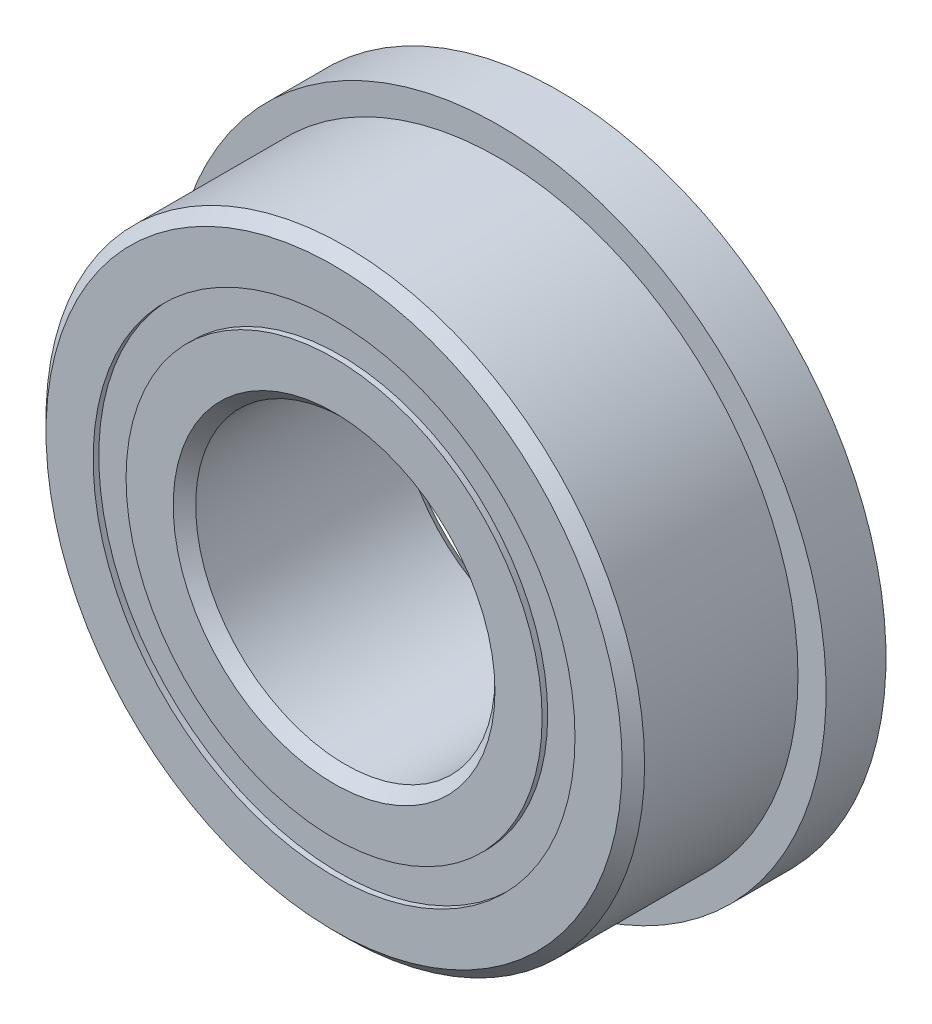
ISO-10303-21;
HEADER;
FILE_DESCRIPTION(('STEP AP214'),'2;1');
FILE_NAME('part.step','',(''),(''),'','','');
FILE_SCHEMA(('AUTOMOTIVE_DESIGN { 1 0 10303 214 1 1 1 1 }'));
ENDSEC;
DATA;
#1=APPLICATION_CONTEXT('core data for automotive mechanical design processes');
#2=APPLICATION_PROTOCOL_DEFINITION('international standard','automotive_design',2000,#1);
#3=PRODUCT_CONTEXT('',#1,'mechanical');
#4=PRODUCT('Part','Part','',(#3));
#5=PRODUCT_RELATED_PRODUCT_CATEGORY('part','',(#4));
#6=PRODUCT_DEFINITION_FORMATION('','',#4);
#7=PRODUCT_DEFINITION_CONTEXT('part definition',#1,'design');
#8=PRODUCT_DEFINITION('design','',#6,#7);
#9=PRODUCT_DEFINITION_SHAPE('','',#8);
#10=(LENGTH_UNIT() NAMED_UNIT(*) SI_UNIT(.MILLI.,.METRE.));
#11=(NAMED_UNIT(*) PLANE_ANGLE_UNIT() SI_UNIT($,.RADIAN.));
#12=(NAMED_UNIT(*) SI_UNIT($,.STERADIAN.) SOLID_ANGLE_UNIT());
#13=UNCERTAINTY_MEASURE_WITH_UNIT(LENGTH_MEASURE(1.E-05),#10,'distance_accuracy_value','');
#14=(GEOMETRIC_REPRESENTATION_CONTEXT(3) GLOBAL_UNCERTAINTY_ASSIGNED_CONTEXT((#13)) GLOBAL_UNIT_ASSIGNED_CONTEXT((#10,
#11,#12)) REPRESENTATION_CONTEXT('',''));
#15=CARTESIAN_POINT('',(0.,0.,0.));
#16=DIRECTION('',(0.,0.,1.));
#17=DIRECTION('',(1.,0.,0.));
#18=AXIS2_PLACEMENT_3D('',#15,#16,#17);
#19=CARTESIAN_POINT('',(0.,5.1114010989011,-2.2621875));
#20=DIRECTION('',(0.,0.,1.));
#21=DIRECTION('',(1.,0.,0.));
#22=AXIS2_PLACEMENT_3D('',#19,#20,#21);
#23=PLANE('',#22);
#24=CARTESIAN_POINT('',(0.,0.,-2.2621875));
#25=DIRECTION('',(0.,0.,1.));
#26=DIRECTION('',(1.,0.,0.));
#27=AXIS2_PLACEMENT_3D('',#24,#25,#26);
#28=CIRCLE('',#27,5.1114010989011);
#29=CARTESIAN_POINT('',(5.1114010989011,0.,-2.2621875));
#30=VERTEX_POINT('',#29);
#31=EDGE_CURVE('E55',#30,#30,#28,.T.);
#32=ORIENTED_EDGE('',*,*,#31,.F.);
#33=EDGE_LOOP('',(#32));
#34=FACE_BOUND('',#33,.T.);
#35=CARTESIAN_POINT('',(0.,0.,-2.2621875));
#36=DIRECTION('',(0.,0.,1.));
#37=DIRECTION('',(1.,0.,0.));
#38=AXIS2_PLACEMENT_3D('',#35,#36,#37);
#39=CIRCLE('',#38,4.4135989010989);
#40=CARTESIAN_POINT('',(4.4135989010989,0.,-2.2621875));
#41=VERTEX_POINT('',#40);
#42=EDGE_CURVE('E11',#41,#41,#39,.T.);
#43=ORIENTED_EDGE('',*,*,#42,.T.);
#44=EDGE_LOOP('',(#43));
#45=FACE_BOUND('',#44,.T.);
#46=ADVANCED_FACE('F41',(#34,#45),#23,.F.);
#47=CARTESIAN_POINT('',(0.,0.,2.38125));
#48=DIRECTION('',(0.,0.,1.));
#49=DIRECTION('',(1.,0.,0.));
#50=AXIS2_PLACEMENT_3D('',#47,#48,#49);
#51=CYLINDRICAL_SURFACE('',#50,4.4135989010989);
#52=ORIENTED_EDGE('',*,*,#42,.F.);
#53=EDGE_LOOP('',(#52));
#54=FACE_BOUND('',#53,.T.);
#55=CARTESIAN_POINT('',(0.,0.,-1.11436144103197));
#56=DIRECTION('',(0.,0.,1.));
#57=DIRECTION('',(1.,0.,0.));
#58=AXIS2_PLACEMENT_3D('',#55,#56,#57);
#59=CIRCLE('',#58,4.4135989010989);
#60=CARTESIAN_POINT('',(4.4135989010989,0.,-1.11436144103197));
#61=VERTEX_POINT('',#60);
#62=EDGE_CURVE('E47',#61,#61,#59,.T.);
#63=ORIENTED_EDGE('',*,*,#62,.T.);
#64=EDGE_LOOP('',(#63));
#65=FACE_BOUND('',#64,.T.);
#66=ADVANCED_FACE('F64',(#54,#65),#51,.F.);
#67=CARTESIAN_POINT('',(0.,5.1114010989011,-1.11436144103197));
#68=DIRECTION('',(0.,0.,-1.));
#69=DIRECTION('',(-1.,0.,0.));
#70=AXIS2_PLACEMENT_3D('',#67,#68,#69);
#71=PLANE('',#70);
#72=ORIENTED_EDGE('',*,*,#62,.F.);
#73=EDGE_LOOP('',(#72));
#74=FACE_BOUND('',#73,.T.);
#75=CARTESIAN_POINT('',(0.,0.,-1.11436144103197));
#76=DIRECTION('',(0.,0.,1.));
#77=DIRECTION('',(1.,0.,0.));
#78=AXIS2_PLACEMENT_3D('',#75,#76,#77);
#79=CIRCLE('',#78,5.1114010989011);
#80=CARTESIAN_POINT('',(5.1114010989011,0.,-1.11436144103197));
#81=VERTEX_POINT('',#80);
#82=EDGE_CURVE('E51',#81,#81,#79,.T.);
#83=ORIENTED_EDGE('',*,*,#82,.T.);
#84=EDGE_LOOP('',(#83));
#85=FACE_BOUND('',#84,.T.);
#86=ADVANCED_FACE('F68',(#74,#85),#71,.F.);
#87=CARTESIAN_POINT('',(0.,0.,2.38125));
#88=DIRECTION('',(0.,0.,1.));
#89=DIRECTION('',(1.,0.,0.));
#90=AXIS2_PLACEMENT_3D('',#87,#88,#89);
#91=CYLINDRICAL_SURFACE('',#90,5.1114010989011);
#92=ORIENTED_EDGE('',*,*,#82,.F.);
#93=EDGE_LOOP('',(#92));
#94=FACE_BOUND('',#93,.T.);
#95=ORIENTED_EDGE('',*,*,#31,.T.);
#96=EDGE_LOOP('',(#95));
#97=FACE_BOUND('',#96,.T.);
#98=ADVANCED_FACE('F61',(#94,#97),#91,.T.);
#99=CLOSED_SHELL('',(#46,#66,#86,#98));
#100=MANIFOLD_SOLID_BREP('B2',#99);
#101=CARTESIAN_POINT('',(0.,5.1114010989011,2.2621875));
#102=DIRECTION('',(0.,0.,-1.));
#103=DIRECTION('',(-1.,0.,0.));
#104=AXIS2_PLACEMENT_3D('',#101,#102,#103);
#105=PLANE('',#104);
#106=CARTESIAN_POINT('',(0.,0.,2.2621875));
#107=DIRECTION('',(0.,0.,1.));
#108=DIRECTION('',(1.,0.,0.));
#109=AXIS2_PLACEMENT_3D('',#106,#107,#108);
#110=CIRCLE('',#109,4.4135989010989);
#111=CARTESIAN_POINT('',(4.4135989010989,0.,2.2621875));
#112=VERTEX_POINT('',#111);
#113=EDGE_CURVE('E40',#112,#112,#110,.T.);
#114=ORIENTED_EDGE('',*,*,#113,.F.);
#115=EDGE_LOOP('',(#114));
#116=FACE_BOUND('',#115,.T.);
#117=CARTESIAN_POINT('',(0.,0.,2.2621875));
#118=DIRECTION('',(0.,0.,1.));
#119=DIRECTION('',(1.,0.,0.));
#120=AXIS2_PLACEMENT_3D('',#117,#118,#119);
#121=CIRCLE('',#120,5.1114010989011);
#122=CARTESIAN_POINT('',(5.1114010989011,0.,2.2621875));
#123=VERTEX_POINT('',#122);
#124=EDGE_CURVE('E122',#123,#123,#121,.T.);
#125=ORIENTED_EDGE('',*,*,#124,.T.);
#126=EDGE_LOOP('',(#125));
#127=FACE_BOUND('',#126,.T.);
#128=ADVANCED_FACE('F108',(#116,#127),#105,.F.);
#129=CARTESIAN_POINT('',(0.,0.,2.38125));
#130=DIRECTION('',(0.,0.,1.));
#131=DIRECTION('',(1.,0.,0.));
#132=AXIS2_PLACEMENT_3D('',#129,#130,#131);
#133=CYLINDRICAL_SURFACE('',#132,4.4135989010989);
#134=CARTESIAN_POINT('',(0.,0.,1.11436144103197));
#135=DIRECTION('',(0.,0.,1.));
#136=DIRECTION('',(1.,0.,0.));
#137=AXIS2_PLACEMENT_3D('',#134,#135,#136);
#138=CIRCLE('',#137,4.4135989010989);
#139=CARTESIAN_POINT('',(4.4135989010989,0.,1.11436144103197));
#140=VERTEX_POINT('',#139);
#141=EDGE_CURVE('E114',#140,#140,#138,.T.);
#142=ORIENTED_EDGE('',*,*,#141,.F.);
#143=EDGE_LOOP('',(#142));
#144=FACE_BOUND('',#143,.T.);
#145=ORIENTED_EDGE('',*,*,#113,.T.);
#146=EDGE_LOOP('',(#145));
#147=FACE_BOUND('',#146,.T.);
#148=ADVANCED_FACE('F137',(#144,#147),#133,.F.);
#149=CARTESIAN_POINT('',(0.,5.1114010989011,1.11436144103197));
#150=DIRECTION('',(0.,0.,1.));
#151=DIRECTION('',(1.,0.,0.));
#152=AXIS2_PLACEMENT_3D('',#149,#150,#151);
#153=PLANE('',#152);
#154=CARTESIAN_POINT('',(0.,0.,1.11436144103197));
#155=DIRECTION('',(0.,0.,1.));
#156=DIRECTION('',(1.,0.,0.));
#157=AXIS2_PLACEMENT_3D('',#154,#155,#156);
#158=CIRCLE('',#157,5.1114010989011);
#159=CARTESIAN_POINT('',(5.1114010989011,0.,1.11436144103197));
#160=VERTEX_POINT('',#159);
#161=EDGE_CURVE('E118',#160,#160,#158,.T.);
#162=ORIENTED_EDGE('',*,*,#161,.F.);
#163=EDGE_LOOP('',(#162));
#164=FACE_BOUND('',#163,.T.);
#165=ORIENTED_EDGE('',*,*,#141,.T.);
#166=EDGE_LOOP('',(#165));
#167=FACE_BOUND('',#166,.T.);
#168=ADVANCED_FACE('F132',(#164,#167),#153,.F.);
#169=CARTESIAN_POINT('',(0.,0.,2.38125));
#170=DIRECTION('',(0.,0.,1.));
#171=DIRECTION('',(1.,0.,0.));
#172=AXIS2_PLACEMENT_3D('',#169,#170,#171);
#173=CYLINDRICAL_SURFACE('',#172,5.1114010989011);
#174=ORIENTED_EDGE('',*,*,#124,.F.);
#175=EDGE_LOOP('',(#174));
#176=FACE_BOUND('',#175,.T.);
#177=ORIENTED_EDGE('',*,*,#161,.T.);
#178=EDGE_LOOP('',(#177));
#179=FACE_BOUND('',#178,.T.);
#180=ADVANCED_FACE('F129',(#176,#179),#173,.T.);
#181=CLOSED_SHELL('',(#128,#148,#168,#180));
#182=MANIFOLD_SOLID_BREP('B6',#181);
#183=CARTESIAN_POINT('',(-2.38124999999995,4.12444598552342,0.));
#184=DIRECTION('',(0.,0.,1.));
#185=DIRECTION('',(-0.499999999999989,0.866025403784445,0.));
#186=AXIS2_PLACEMENT_3D('',#183,#184,#185);
#187=SPHERICAL_SURFACE('',#186,1.11436144103197);
#188=CARTESIAN_POINT('',(-2.38124999999995,4.12444598552342,1.11436144103197));
#189=VERTEX_POINT('',#188);
#190=VERTEX_LOOP('',#189);
#191=FACE_BOUND('',#190,.T.);
#192=ADVANCED_FACE('F175',(#191),#187,.T.);
#193=CLOSED_SHELL('',(#192));
#194=MANIFOLD_SOLID_BREP('B35',#193);
#195=CARTESIAN_POINT('',(-4.12444598552336,2.38125000000005,0.));
#196=DIRECTION('',(0.,0.,1.));
#197=DIRECTION('',(-0.866025403784433,0.50000000000001,0.));
#198=AXIS2_PLACEMENT_3D('',#195,#196,#197);
#199=SPHERICAL_SURFACE('',#198,1.11436144103197);
#200=CARTESIAN_POINT('',(-4.12444598552336,2.38125000000005,1.11436144103197));
#201=VERTEX_POINT('',#200);
#202=VERTEX_LOOP('',#201);
#203=FACE_BOUND('',#202,.T.);
#204=ADVANCED_FACE('F195',(#203),#199,.T.);
#205=CLOSED_SHELL('',(#204));
#206=MANIFOLD_SOLID_BREP('B104',#205);
#207=CARTESIAN_POINT('',(-4.7625,0.,0.));
#208=DIRECTION('',(0.,0.,1.));
#209=DIRECTION('',(-1.,0.,0.));
#210=AXIS2_PLACEMENT_3D('',#207,#208,#209);
#211=SPHERICAL_SURFACE('',#210,1.11436144103197);
#212=CARTESIAN_POINT('',(-4.7625,0.,1.11436144103197));
#213=VERTEX_POINT('',#212);
#214=VERTEX_LOOP('',#213);
#215=FACE_BOUND('',#214,.T.);
#216=ADVANCED_FACE('F215',(#215),#211,.T.);
#217=CLOSED_SHELL('',(#216));
#218=MANIFOLD_SOLID_BREP('B171',#217);
#219=CARTESIAN_POINT('',(-4.12444598552341,-2.38124999999996,0.));
#220=DIRECTION('',(0.,0.,1.));
#221=DIRECTION('',(-0.866025403784443,-0.499999999999992,0.));
#222=AXIS2_PLACEMENT_3D('',#219,#220,#221);
#223=SPHERICAL_SURFACE('',#222,1.11436144103197);
#224=CARTESIAN_POINT('',(-4.12444598552341,-2.38124999999996,1.11436144103197));
#225=VERTEX_POINT('',#224);
#226=VERTEX_LOOP('',#225);
#227=FACE_BOUND('',#226,.T.);
#228=ADVANCED_FACE('F235',(#227),#223,.T.);
#229=CLOSED_SHELL('',(#228));
#230=MANIFOLD_SOLID_BREP('B191',#229);
#231=CARTESIAN_POINT('',(-2.38125000000003,-4.12444598552337,0.));
#232=DIRECTION('',(0.,0.,1.));
#233=DIRECTION('',(-0.500000000000007,-0.866025403784435,0.));
#234=AXIS2_PLACEMENT_3D('',#231,#232,#233);
#235=SPHERICAL_SURFACE('',#234,1.11436144103197);
#236=CARTESIAN_POINT('',(-2.38125000000003,-4.12444598552337,1.11436144103197));
#237=VERTEX_POINT('',#236);
#238=VERTEX_LOOP('',#237);
#239=FACE_BOUND('',#238,.T.);
#240=ADVANCED_FACE('F255',(#239),#235,.T.);
#241=CLOSED_SHELL('',(#240));
#242=MANIFOLD_SOLID_BREP('B211',#241);
#243=CARTESIAN_POINT('',(0.,-4.7625,0.));
#244=DIRECTION('',(0.,0.,1.));
#245=DIRECTION('',(0.,-1.,0.));
#246=AXIS2_PLACEMENT_3D('',#243,#244,#245);
#247=SPHERICAL_SURFACE('',#246,1.11436144103197);
#248=CARTESIAN_POINT('',(0.,-4.7625,1.11436144103197));
#249=VERTEX_POINT('',#248);
#250=VERTEX_LOOP('',#249);
#251=FACE_BOUND('',#250,.T.);
#252=ADVANCED_FACE('F275',(#251),#247,.T.);
#253=CLOSED_SHELL('',(#252));
#254=MANIFOLD_SOLID_BREP('B231',#253);
#255=CARTESIAN_POINT('',(2.38124999999998,-4.1244459855234,0.));
#256=DIRECTION('',(0.,0.,1.));
#257=DIRECTION('',(0.499999999999995,-0.866025403784442,0.));
#258=AXIS2_PLACEMENT_3D('',#255,#256,#257);
#259=SPHERICAL_SURFACE('',#258,1.11436144103197);
#260=CARTESIAN_POINT('',(2.38124999999998,-4.1244459855234,1.11436144103197));
#261=VERTEX_POINT('',#260);
#262=VERTEX_LOOP('',#261);
#263=FACE_BOUND('',#262,.T.);
#264=ADVANCED_FACE('F295',(#263),#259,.T.);
#265=CLOSED_SHELL('',(#264));
#266=MANIFOLD_SOLID_BREP('B251',#265);
#267=CARTESIAN_POINT('',(4.12444598552338,-2.38125000000002,0.));
#268=DIRECTION('',(0.,0.,1.));
#269=DIRECTION('',(0.866025403784436,-0.500000000000004,0.));
#270=AXIS2_PLACEMENT_3D('',#267,#268,#269);
#271=SPHERICAL_SURFACE('',#270,1.11436144103197);
#272=CARTESIAN_POINT('',(4.12444598552338,-2.38125000000002,1.11436144103197));
#273=VERTEX_POINT('',#272);
#274=VERTEX_LOOP('',#273);
#275=FACE_BOUND('',#274,.T.);
#276=ADVANCED_FACE('F315',(#275),#271,.T.);
#277=CLOSED_SHELL('',(#276));
#278=MANIFOLD_SOLID_BREP('B271',#277);
#279=CARTESIAN_POINT('',(4.7625,0.,0.));
#280=DIRECTION('',(0.,0.,1.));
#281=DIRECTION('',(1.,0.,0.));
#282=AXIS2_PLACEMENT_3D('',#279,#280,#281);
#283=SPHERICAL_SURFACE('',#282,1.11436144103197);
#284=CARTESIAN_POINT('',(4.7625,0.,1.11436144103197));
#285=VERTEX_POINT('',#284);
#286=VERTEX_LOOP('',#285);
#287=FACE_BOUND('',#286,.T.);
#288=ADVANCED_FACE('F335',(#287),#283,.T.);
#289=CLOSED_SHELL('',(#288));
#290=MANIFOLD_SOLID_BREP('B291',#289);
#291=CARTESIAN_POINT('',(4.12444598552339,2.38124999999999,0.));
#292=DIRECTION('',(0.,0.,1.));
#293=DIRECTION('',(0.86602540378444,0.499999999999998,0.));
#294=AXIS2_PLACEMENT_3D('',#291,#292,#293);
#295=SPHERICAL_SURFACE('',#294,1.11436144103197);
#296=CARTESIAN_POINT('',(4.12444598552339,2.38124999999999,1.11436144103197));
#297=VERTEX_POINT('',#296);
#298=VERTEX_LOOP('',#297);
#299=FACE_BOUND('',#298,.T.);
#300=ADVANCED_FACE('F355',(#299),#295,.T.);
#301=CLOSED_SHELL('',(#300));
#302=MANIFOLD_SOLID_BREP('B311',#301);
#303=CARTESIAN_POINT('',(2.38125,4.12444598552339,0.));
#304=DIRECTION('',(0.,0.,1.));
#305=DIRECTION('',(0.500000000000001,0.866025403784438,0.));
#306=AXIS2_PLACEMENT_3D('',#303,#304,#305);
#307=SPHERICAL_SURFACE('',#306,1.11436144103197);
#308=CARTESIAN_POINT('',(2.38125,4.12444598552339,1.11436144103197));
#309=VERTEX_POINT('',#308);
#310=VERTEX_LOOP('',#309);
#311=FACE_BOUND('',#310,.T.);
#312=ADVANCED_FACE('F375',(#311),#307,.T.);
#313=CLOSED_SHELL('',(#312));
#314=MANIFOLD_SOLID_BREP('B331',#313);
#315=CARTESIAN_POINT('',(0.,4.7625,0.));
#316=DIRECTION('',(0.,0.,1.));
#317=DIRECTION('',(0.,1.,0.));
#318=AXIS2_PLACEMENT_3D('',#315,#316,#317);
#319=SPHERICAL_SURFACE('',#318,1.11436144103197);
#320=CARTESIAN_POINT('',(0.,4.7625,1.11436144103197));
#321=VERTEX_POINT('',#320);
#322=VERTEX_LOOP('',#321);
#323=FACE_BOUND('',#322,.T.);
#324=ADVANCED_FACE('F397',(#323),#319,.T.);
#325=CLOSED_SHELL('',(#324));
#326=MANIFOLD_SOLID_BREP('B351',#325);
#327=CARTESIAN_POINT('',(0.,4.4135989010989,2.38125));
#328=DIRECTION('',(0.,0.,-1.));
#329=DIRECTION('',(-1.,0.,0.));
#330=AXIS2_PLACEMENT_3D('',#327,#328,#329);
#331=PLANE('',#330);
#332=CARTESIAN_POINT('',(0.,0.,2.38125));
#333=DIRECTION('',(0.,0.,1.));
#334=DIRECTION('',(1.,0.,0.));
#335=AXIS2_PLACEMENT_3D('',#332,#333,#334);
#336=CIRCLE('',#335,3.413125);
#337=CARTESIAN_POINT('',(3.413125,0.,2.38125));
#338=VERTEX_POINT('',#337);
#339=EDGE_CURVE('E444',#338,#338,#336,.T.);
#340=ORIENTED_EDGE('',*,*,#339,.F.);
#341=EDGE_LOOP('',(#340));
#342=FACE_BOUND('',#341,.T.);
#343=CARTESIAN_POINT('',(0.,0.,2.38125));
#344=DIRECTION('',(0.,0.,1.));
#345=DIRECTION('',(1.,0.,0.));
#346=AXIS2_PLACEMENT_3D('',#343,#344,#345);
#347=CIRCLE('',#346,4.4135989010989);
#348=CARTESIAN_POINT('',(4.4135989010989,0.,2.38125));
#349=VERTEX_POINT('',#348);
#350=EDGE_CURVE('E396',#349,#349,#347,.T.);
#351=ORIENTED_EDGE('',*,*,#350,.T.);
#352=EDGE_LOOP('',(#351));
#353=FACE_BOUND('',#352,.T.);
#354=ADVANCED_FACE('F416',(#342,#353),#331,.F.);
#355=CARTESIAN_POINT('',(0.,0.,2.38125));
#356=DIRECTION('',(0.,0.,1.));
#357=DIRECTION('',(1.,0.,0.));
#358=AXIS2_PLACEMENT_3D('',#355,#356,#357);
#359=CYLINDRICAL_SURFACE('',#358,4.4135989010989);
#360=ORIENTED_EDGE('',*,*,#350,.F.);
#361=EDGE_LOOP('',(#360));
#362=FACE_BOUND('',#361,.T.);
#363=CARTESIAN_POINT('',(0.,0.,1.05833333333333));
#364=DIRECTION('',(0.,0.,1.));
#365=DIRECTION('',(1.,0.,0.));
#366=AXIS2_PLACEMENT_3D('',#363,#364,#365);
#367=CIRCLE('',#366,4.4135989010989);
#368=CARTESIAN_POINT('',(4.4135989010989,0.,1.05833333333333));
#369=VERTEX_POINT('',#368);
#370=EDGE_CURVE('E422',#369,#369,#367,.T.);
#371=ORIENTED_EDGE('',*,*,#370,.T.);
#372=EDGE_LOOP('',(#371));
#373=FACE_BOUND('',#372,.T.);
#374=ADVANCED_FACE('F451',(#362,#373),#359,.T.);
#375=CARTESIAN_POINT('',(0.,0.,0.));
#376=DIRECTION('',(0.,0.,1.));
#377=DIRECTION('',(1.,0.,0.));
#378=AXIS2_PLACEMENT_3D('',#375,#376,#377);
#379=TOROIDAL_SURFACE('',#378,4.76249999999999,1.11436144103196);
#380=ORIENTED_EDGE('',*,*,#370,.F.);
#381=EDGE_LOOP('',(#380));
#382=FACE_BOUND('',#381,.T.);
#383=CARTESIAN_POINT('',(0.,0.,-1.05833333333333));
#384=DIRECTION('',(0.,0.,1.));
#385=DIRECTION('',(1.,0.,0.));
#386=AXIS2_PLACEMENT_3D('',#383,#384,#385);
#387=CIRCLE('',#386,4.4135989010989);
#388=CARTESIAN_POINT('',(4.4135989010989,0.,-1.05833333333333));
#389=VERTEX_POINT('',#388);
#390=EDGE_CURVE('E426',#389,#389,#387,.T.);
#391=ORIENTED_EDGE('',*,*,#390,.T.);
#392=EDGE_LOOP('',(#391));
#393=FACE_BOUND('',#392,.T.);
#394=ADVANCED_FACE('F455',(#382,#393),#379,.F.);
#395=CARTESIAN_POINT('',(0.,0.,2.38125));
#396=DIRECTION('',(0.,0.,1.));
#397=DIRECTION('',(1.,0.,0.));
#398=AXIS2_PLACEMENT_3D('',#395,#396,#397);
#399=CYLINDRICAL_SURFACE('',#398,4.4135989010989);
#400=ORIENTED_EDGE('',*,*,#390,.F.);
#401=EDGE_LOOP('',(#400));
#402=FACE_BOUND('',#401,.T.);
#403=CARTESIAN_POINT('',(0.,0.,-2.38125));
#404=DIRECTION('',(0.,0.,1.));
#405=DIRECTION('',(1.,0.,0.));
#406=AXIS2_PLACEMENT_3D('',#403,#404,#405);
#407=CIRCLE('',#406,4.4135989010989);
#408=CARTESIAN_POINT('',(4.4135989010989,0.,-2.38125));
#409=VERTEX_POINT('',#408);
#410=EDGE_CURVE('E430',#409,#409,#407,.T.);
#411=ORIENTED_EDGE('',*,*,#410,.T.);
#412=EDGE_LOOP('',(#411));
#413=FACE_BOUND('',#412,.T.);
#414=ADVANCED_FACE('F460',(#402,#413),#399,.T.);
#415=CARTESIAN_POINT('',(0.,3.413125,-2.38125));
#416=DIRECTION('',(0.,0.,1.));
#417=DIRECTION('',(1.,0.,0.));
#418=AXIS2_PLACEMENT_3D('',#415,#416,#417);
#419=PLANE('',#418);
#420=ORIENTED_EDGE('',*,*,#410,.F.);
#421=EDGE_LOOP('',(#420));
#422=FACE_BOUND('',#421,.T.);
#423=CARTESIAN_POINT('',(0.,0.,-2.38125));
#424=DIRECTION('',(0.,0.,1.));
#425=DIRECTION('',(1.,0.,0.));
#426=AXIS2_PLACEMENT_3D('',#423,#424,#425);
#427=CIRCLE('',#426,3.413125);
#428=CARTESIAN_POINT('',(3.413125,0.,-2.38125));
#429=VERTEX_POINT('',#428);
#430=EDGE_CURVE('E435',#429,#429,#427,.T.);
#431=ORIENTED_EDGE('',*,*,#430,.T.);
#432=EDGE_LOOP('',(#431));
#433=FACE_BOUND('',#432,.T.);
#434=ADVANCED_FACE('F466',(#422,#433),#419,.F.);
#435=CARTESIAN_POINT('',(0.,0.,-2.143125));
#436=DIRECTION('',(0.,0.,-1.));
#437=DIRECTION('',(-1.,0.,0.));
#438=AXIS2_PLACEMENT_3D('',#435,#436,#437);
#439=CONICAL_SURFACE('',#438,3.175,0.785398163397447);
#440=ORIENTED_EDGE('',*,*,#430,.F.);
#441=EDGE_LOOP('',(#440));
#442=FACE_BOUND('',#441,.T.);
#443=CARTESIAN_POINT('',(0.,0.,-2.143125));
#444=DIRECTION('',(0.,0.,1.));
#445=DIRECTION('',(1.,0.,0.));
#446=AXIS2_PLACEMENT_3D('',#443,#444,#445);
#447=CIRCLE('',#446,3.175);
#448=CARTESIAN_POINT('',(3.175,0.,-2.143125));
#449=VERTEX_POINT('',#448);
#450=EDGE_CURVE('E438',#449,#449,#447,.T.);
#451=ORIENTED_EDGE('',*,*,#450,.T.);
#452=EDGE_LOOP('',(#451));
#453=FACE_BOUND('',#452,.T.);
#454=ADVANCED_FACE('F470',(#442,#453),#439,.F.);
#455=CARTESIAN_POINT('',(0.,0.,2.38125));
#456=DIRECTION('',(0.,0.,1.));
#457=DIRECTION('',(1.,0.,0.));
#458=AXIS2_PLACEMENT_3D('',#455,#456,#457);
#459=CYLINDRICAL_SURFACE('',#458,3.175);
#460=ORIENTED_EDGE('',*,*,#450,.F.);
#461=EDGE_LOOP('',(#460));
#462=FACE_BOUND('',#461,.T.);
#463=CARTESIAN_POINT('',(0.,0.,2.143125));
#464=DIRECTION('',(0.,0.,1.));
#465=DIRECTION('',(1.,0.,0.));
#466=AXIS2_PLACEMENT_3D('',#463,#464,#465);
#467=CIRCLE('',#466,3.175);
#468=CARTESIAN_POINT('',(3.175,0.,2.143125));
#469=VERTEX_POINT('',#468);
#470=EDGE_CURVE('E441',#469,#469,#467,.T.);
#471=ORIENTED_EDGE('',*,*,#470,.T.);
#472=EDGE_LOOP('',(#471));
#473=FACE_BOUND('',#472,.T.);
#474=ADVANCED_FACE('F474',(#462,#473),#459,.F.);
#475=CARTESIAN_POINT('',(0.,0.,2.38125));
#476=DIRECTION('',(0.,0.,1.));
#477=DIRECTION('',(1.,0.,0.));
#478=AXIS2_PLACEMENT_3D('',#475,#476,#477);
#479=CONICAL_SURFACE('',#478,3.413125,0.785398163397448);
#480=ORIENTED_EDGE('',*,*,#470,.F.);
#481=EDGE_LOOP('',(#480));
#482=FACE_BOUND('',#481,.T.);
#483=ORIENTED_EDGE('',*,*,#339,.T.);
#484=EDGE_LOOP('',(#483));
#485=FACE_BOUND('',#484,.T.);
#486=ADVANCED_FACE('F448',(#482,#485),#479,.F.);
#487=CLOSED_SHELL('',(#354,#374,#394,#414,#434,#454,#474,#486));
#488=MANIFOLD_SOLID_BREP('B371',#487);
#489=CARTESIAN_POINT('',(0.,0.,2.143125));
#490=DIRECTION('',(0.,0.,-1.));
#491=DIRECTION('',(-1.,0.,0.));
#492=AXIS2_PLACEMENT_3D('',#489,#490,#491);
#493=CONICAL_SURFACE('',#492,6.35,0.785398163397449);
#494=CARTESIAN_POINT('',(0.,0.,2.38125));
#495=DIRECTION('',(0.,0.,1.));
#496=DIRECTION('',(1.,0.,0.));
#497=AXIS2_PLACEMENT_3D('',#494,#495,#496);
#498=CIRCLE('',#497,6.111875);
#499=CARTESIAN_POINT('',(6.111875,0.,2.38125));
#500=VERTEX_POINT('',#499);
#501=EDGE_CURVE('E559',#500,#500,#498,.T.);
#502=ORIENTED_EDGE('',*,*,#501,.F.);
#503=EDGE_LOOP('',(#502));
#504=FACE_BOUND('',#503,.T.);
#505=CARTESIAN_POINT('',(0.,0.,2.143125));
#506=DIRECTION('',(0.,0.,1.));
#507=DIRECTION('',(1.,0.,0.));
#508=AXIS2_PLACEMENT_3D('',#505,#506,#507);
#509=CIRCLE('',#508,6.35);
#510=CARTESIAN_POINT('',(6.35,0.,2.143125));
#511=VERTEX_POINT('',#510);
#512=EDGE_CURVE('E415',#511,#511,#509,.T.);
#513=ORIENTED_EDGE('',*,*,#512,.T.);
#514=EDGE_LOOP('',(#513));
#515=FACE_BOUND('',#514,.T.);
#516=ADVANCED_FACE('F537',(#504,#515),#493,.T.);
#517=CARTESIAN_POINT('',(0.,0.,2.38125));
#518=DIRECTION('',(0.,0.,1.));
#519=DIRECTION('',(1.,0.,0.));
#520=AXIS2_PLACEMENT_3D('',#517,#518,#519);
#521=CYLINDRICAL_SURFACE('',#520,6.35);
#522=CARTESIAN_POINT('',(0.,0.,-1.11125));
#523=DIRECTION('',(0.,0.,1.));
#524=DIRECTION('',(1.,0.,0.));
#525=AXIS2_PLACEMENT_3D('',#522,#523,#524);
#526=CIRCLE('',#525,6.35);
#527=CARTESIAN_POINT('',(6.35,0.,-1.11125));
#528=VERTEX_POINT('',#527);
#529=EDGE_CURVE('E562',#528,#528,#526,.T.);
#530=ORIENTED_EDGE('',*,*,#529,.T.);
#531=EDGE_LOOP('',(#530));
#532=FACE_BOUND('',#531,.T.);
#533=ORIENTED_EDGE('',*,*,#512,.F.);
#534=EDGE_LOOP('',(#533));
#535=FACE_BOUND('',#534,.T.);
#536=ADVANCED_FACE('F582',(#532,#535),#521,.T.);
#537=CARTESIAN_POINT('',(0.,6.111875,-2.38125));
#538=DIRECTION('',(0.,0.,1.));
#539=DIRECTION('',(1.,0.,0.));
#540=AXIS2_PLACEMENT_3D('',#537,#538,#539);
#541=PLANE('',#540);
#542=CARTESIAN_POINT('',(0.,0.,-2.38125));
#543=DIRECTION('',(0.,0.,1.));
#544=DIRECTION('',(1.,0.,0.));
#545=AXIS2_PLACEMENT_3D('',#542,#543,#544);
#546=CIRCLE('',#545,5.1114010989011);
#547=CARTESIAN_POINT('',(5.1114010989011,0.,-2.38125));
#548=VERTEX_POINT('',#547);
#549=EDGE_CURVE('E543',#548,#548,#546,.T.);
#550=ORIENTED_EDGE('',*,*,#549,.T.);
#551=EDGE_LOOP('',(#550));
#552=FACE_BOUND('',#551,.T.);
#553=CARTESIAN_POINT('',(0.,0.,-2.38125));
#554=DIRECTION('',(0.,0.,-1.));
#555=DIRECTION('',(-1.,0.,0.));
#556=AXIS2_PLACEMENT_3D('',#553,#554,#555);
#557=CIRCLE('',#556,6.9469);
#558=CARTESIAN_POINT('',(-6.9469,0.,-2.38125));
#559=VERTEX_POINT('',#558);
#560=EDGE_CURVE('E565',#559,#559,#557,.T.);
#561=ORIENTED_EDGE('',*,*,#560,.T.);
#562=EDGE_LOOP('',(#561));
#563=FACE_BOUND('',#562,.T.);
#564=ADVANCED_FACE('F585',(#552,#563),#541,.F.);
#565=CARTESIAN_POINT('',(0.,0.,2.38125));
#566=DIRECTION('',(0.,0.,1.));
#567=DIRECTION('',(1.,0.,0.));
#568=AXIS2_PLACEMENT_3D('',#565,#566,#567);
#569=CYLINDRICAL_SURFACE('',#568,5.1114010989011);
#570=CARTESIAN_POINT('',(0.,0.,-1.05833333333333));
#571=DIRECTION('',(0.,0.,1.));
#572=DIRECTION('',(1.,0.,0.));
#573=AXIS2_PLACEMENT_3D('',#570,#571,#572);
#574=CIRCLE('',#573,5.1114010989011);
#575=CARTESIAN_POINT('',(5.1114010989011,0.,-1.05833333333333));
#576=VERTEX_POINT('',#575);
#577=EDGE_CURVE('E547',#576,#576,#574,.T.);
#578=ORIENTED_EDGE('',*,*,#577,.T.);
#579=EDGE_LOOP('',(#578));
#580=FACE_BOUND('',#579,.T.);
#581=ORIENTED_EDGE('',*,*,#549,.F.);
#582=EDGE_LOOP('',(#581));
#583=FACE_BOUND('',#582,.T.);
#584=ADVANCED_FACE('F590',(#580,#583),#569,.F.);
#585=CARTESIAN_POINT('',(0.,0.,0.));
#586=DIRECTION('',(0.,0.,1.));
#587=DIRECTION('',(1.,0.,0.));
#588=AXIS2_PLACEMENT_3D('',#585,#586,#587);
#589=TOROIDAL_SURFACE('',#588,4.7625,1.11436144103197);
#590=ORIENTED_EDGE('',*,*,#577,.F.);
#591=EDGE_LOOP('',(#590));
#592=FACE_BOUND('',#591,.T.);
#593=CARTESIAN_POINT('',(0.,0.,1.05833333333333));
#594=DIRECTION('',(0.,0.,1.));
#595=DIRECTION('',(1.,0.,0.));
#596=AXIS2_PLACEMENT_3D('',#593,#594,#595);
#597=CIRCLE('',#596,5.1114010989011);
#598=CARTESIAN_POINT('',(5.1114010989011,0.,1.05833333333333));
#599=VERTEX_POINT('',#598);
#600=EDGE_CURVE('E551',#599,#599,#597,.T.);
#601=ORIENTED_EDGE('',*,*,#600,.T.);
#602=EDGE_LOOP('',(#601));
#603=FACE_BOUND('',#602,.T.);
#604=ADVANCED_FACE('F596',(#592,#603),#589,.F.);
#605=CARTESIAN_POINT('',(0.,0.,2.38125));
#606=DIRECTION('',(0.,0.,1.));
#607=DIRECTION('',(1.,0.,0.));
#608=AXIS2_PLACEMENT_3D('',#605,#606,#607);
#609=CYLINDRICAL_SURFACE('',#608,5.1114010989011);
#610=ORIENTED_EDGE('',*,*,#600,.F.);
#611=EDGE_LOOP('',(#610));
#612=FACE_BOUND('',#611,.T.);
#613=CARTESIAN_POINT('',(0.,0.,2.38125));
#614=DIRECTION('',(0.,0.,1.));
#615=DIRECTION('',(1.,0.,0.));
#616=AXIS2_PLACEMENT_3D('',#613,#614,#615);
#617=CIRCLE('',#616,5.1114010989011);
#618=CARTESIAN_POINT('',(5.1114010989011,0.,2.38125));
#619=VERTEX_POINT('',#618);
#620=EDGE_CURVE('E556',#619,#619,#617,.T.);
#621=ORIENTED_EDGE('',*,*,#620,.T.);
#622=EDGE_LOOP('',(#621));
#623=FACE_BOUND('',#622,.T.);
#624=ADVANCED_FACE('F600',(#612,#623),#609,.F.);
#625=CARTESIAN_POINT('',(0.,6.111875,2.38125));
#626=DIRECTION('',(0.,0.,-1.));
#627=DIRECTION('',(-1.,0.,0.));
#628=AXIS2_PLACEMENT_3D('',#625,#626,#627);
#629=PLANE('',#628);
#630=ORIENTED_EDGE('',*,*,#620,.F.);
#631=EDGE_LOOP('',(#630));
#632=FACE_BOUND('',#631,.T.);
#633=ORIENTED_EDGE('',*,*,#501,.T.);
#634=EDGE_LOOP('',(#633));
#635=FACE_BOUND('',#634,.T.);
#636=ADVANCED_FACE('F578',(#632,#635),#629,.F.);
#637=CARTESIAN_POINT('',(0.,5.1114010989011,-1.11125));
#638=DIRECTION('',(0.,0.,1.));
#639=DIRECTION('',(1.,0.,0.));
#640=AXIS2_PLACEMENT_3D('',#637,#638,#639);
#641=PLANE('',#640);
#642=CARTESIAN_POINT('',(0.,0.,-1.11125));
#643=DIRECTION('',(0.,0.,-1.));
#644=DIRECTION('',(-1.,0.,0.));
#645=AXIS2_PLACEMENT_3D('',#642,#643,#644);
#646=CIRCLE('',#645,6.9469);
#647=CARTESIAN_POINT('',(-6.9469,0.,-1.11125));
#648=VERTEX_POINT('',#647);
#649=EDGE_CURVE('E568',#648,#648,#646,.T.);
#650=ORIENTED_EDGE('',*,*,#649,.F.);
#651=EDGE_LOOP('',(#650));
#652=FACE_BOUND('',#651,.T.);
#653=ORIENTED_EDGE('',*,*,#529,.F.);
#654=EDGE_LOOP('',(#653));
#655=FACE_BOUND('',#654,.T.);
#656=ADVANCED_FACE('F575',(#652,#655),#641,.T.);
#657=CARTESIAN_POINT('',(0.,0.,-2.38125));
#658=DIRECTION('',(0.,0.,-1.));
#659=DIRECTION('',(-1.,0.,0.));
#660=AXIS2_PLACEMENT_3D('',#657,#658,#659);
#661=CYLINDRICAL_SURFACE('',#660,6.9469);
#662=ORIENTED_EDGE('',*,*,#649,.T.);
#663=EDGE_LOOP('',(#662));
#664=FACE_BOUND('',#663,.T.);
#665=ORIENTED_EDGE('',*,*,#560,.F.);
#666=EDGE_LOOP('',(#665));
#667=FACE_BOUND('',#666,.T.);
#668=ADVANCED_FACE('F572',(#664,#667),#661,.T.);
#669=CLOSED_SHELL('',(#516,#536,#564,#584,#604,#624,#636,#656,#668));
#670=MANIFOLD_SOLID_BREP('B391',#669);
#671=ADVANCED_BREP_SHAPE_REPRESENTATION('',(#18,#100,#182,#194,#206,#218,#230,#242,#254,#266,
#278,#290,#302,#314,#326,#488,#670),#14);
#672=SHAPE_DEFINITION_REPRESENTATION(#9,#671);
ENDSEC;
END-ISO-10303-21;
